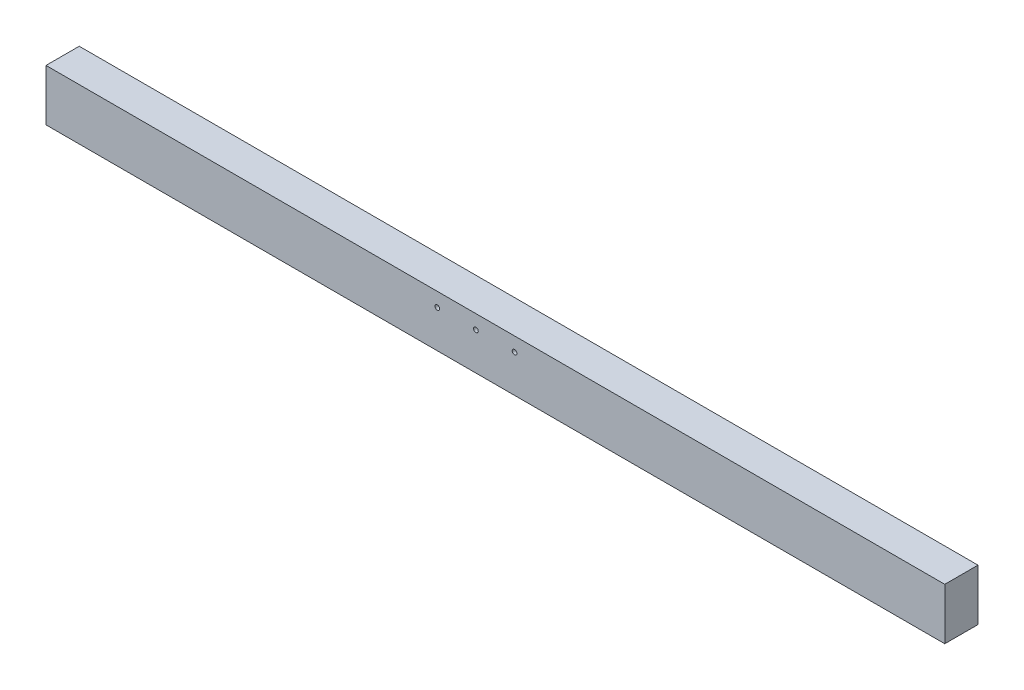
ISO-10303-21;
HEADER;
FILE_DESCRIPTION(('STEP AP214'),'2;1');
FILE_NAME('part.step','',(''),(''),'','','');
FILE_SCHEMA(('AUTOMOTIVE_DESIGN { 1 0 10303 214 1 1 1 1 }'));
ENDSEC;
DATA;
#1=APPLICATION_CONTEXT('core data for automotive mechanical design processes');
#2=APPLICATION_PROTOCOL_DEFINITION('international standard','automotive_design',2000,#1);
#3=PRODUCT_CONTEXT('',#1,'mechanical');
#4=PRODUCT('Part','Part','',(#3));
#5=PRODUCT_RELATED_PRODUCT_CATEGORY('part','',(#4));
#6=PRODUCT_DEFINITION_FORMATION('','',#4);
#7=PRODUCT_DEFINITION_CONTEXT('part definition',#1,'design');
#8=PRODUCT_DEFINITION('design','',#6,#7);
#9=PRODUCT_DEFINITION_SHAPE('','',#8);
#10=(LENGTH_UNIT() NAMED_UNIT(*) SI_UNIT(.MILLI.,.METRE.));
#11=(NAMED_UNIT(*) PLANE_ANGLE_UNIT() SI_UNIT($,.RADIAN.));
#12=(NAMED_UNIT(*) SI_UNIT($,.STERADIAN.) SOLID_ANGLE_UNIT());
#13=UNCERTAINTY_MEASURE_WITH_UNIT(LENGTH_MEASURE(1.E-05),#10,'distance_accuracy_value','');
#14=(GEOMETRIC_REPRESENTATION_CONTEXT(3) GLOBAL_UNCERTAINTY_ASSIGNED_CONTEXT((#13)) GLOBAL_UNIT_ASSIGNED_CONTEXT((#10,
#11,#12)) REPRESENTATION_CONTEXT('',''));
#15=CARTESIAN_POINT('',(0.,0.,0.));
#16=DIRECTION('',(0.,0.,1.));
#17=DIRECTION('',(1.,0.,0.));
#18=AXIS2_PLACEMENT_3D('',#15,#16,#17);
#19=CARTESIAN_POINT('',(1219.2,-76.2,45.085));
#20=DIRECTION('',(0.,0.,-1.));
#21=DIRECTION('',(-1.,0.,0.));
#22=AXIS2_PLACEMENT_3D('',#19,#20,#21);
#23=PLANE('',#22);
#24=CARTESIAN_POINT('',(51.975,-114.3,45.085));
#25=DIRECTION('',(0.,0.,1.));
#26=DIRECTION('',(1.,0.,0.));
#27=AXIS2_PLACEMENT_3D('',#24,#25,#26);
#28=CIRCLE('',#27,6.34999999999999);
#29=CARTESIAN_POINT('',(58.325,-114.3,45.085));
#30=VERTEX_POINT('',#29);
#31=EDGE_CURVE('E122',#30,#30,#28,.T.);
#32=ORIENTED_EDGE('',*,*,#31,.F.);
#33=EDGE_LOOP('',(#32));
#34=FACE_BOUND('',#33,.T.);
#35=CARTESIAN_POINT('',(-52.7999999999877,-114.3,45.085));
#36=DIRECTION('',(0.,0.,1.));
#37=DIRECTION('',(1.,0.,0.));
#38=AXIS2_PLACEMENT_3D('',#35,#36,#37);
#39=CIRCLE('',#38,6.34999999999989);
#40=CARTESIAN_POINT('',(-46.4499999999879,-114.3,45.085));
#41=VERTEX_POINT('',#40);
#42=EDGE_CURVE('E154',#41,#41,#39,.T.);
#43=ORIENTED_EDGE('',*,*,#42,.F.);
#44=EDGE_LOOP('',(#43));
#45=FACE_BOUND('',#44,.T.);
#46=CARTESIAN_POINT('',(-157.574999999975,-114.3,45.085));
#47=DIRECTION('',(0.,0.,1.));
#48=DIRECTION('',(1.,0.,0.));
#49=AXIS2_PLACEMENT_3D('',#46,#47,#48);
#50=CIRCLE('',#49,6.34999999999979);
#51=CARTESIAN_POINT('',(-151.224999999976,-114.3,45.085));
#52=VERTEX_POINT('',#51);
#53=EDGE_CURVE('E158',#52,#52,#50,.T.);
#54=ORIENTED_EDGE('',*,*,#53,.F.);
#55=EDGE_LOOP('',(#54));
#56=FACE_BOUND('',#55,.T.);
#57=DIRECTION('',(0.,-1.,0.));
#58=VECTOR('',#57,1.);
#59=CARTESIAN_POINT('',(-1219.2,-76.2,45.085));
#60=LINE('',#59,#58);
#61=CARTESIAN_POINT('',(-1219.2,-76.2,45.085));
#62=VERTEX_POINT('',#61);
#63=CARTESIAN_POINT('',(-1219.2,-215.9,45.085));
#64=VERTEX_POINT('',#63);
#65=EDGE_CURVE('E111',#62,#64,#60,.T.);
#66=ORIENTED_EDGE('',*,*,#65,.T.);
#67=DIRECTION('',(-1.,0.,0.));
#68=VECTOR('',#67,1.);
#69=CARTESIAN_POINT('',(1219.2,-215.9,45.085));
#70=LINE('',#69,#68);
#71=CARTESIAN_POINT('',(1219.2,-215.9,45.085));
#72=VERTEX_POINT('',#71);
#73=EDGE_CURVE('E11',#72,#64,#70,.T.);
#74=ORIENTED_EDGE('',*,*,#73,.F.);
#75=DIRECTION('',(0.,-1.,0.));
#76=VECTOR('',#75,1.);
#77=CARTESIAN_POINT('',(1219.2,-76.2,45.085));
#78=LINE('',#77,#76);
#79=CARTESIAN_POINT('',(1219.2,-76.2,45.085));
#80=VERTEX_POINT('',#79);
#81=EDGE_CURVE('E98',#80,#72,#78,.T.);
#82=ORIENTED_EDGE('',*,*,#81,.F.);
#83=DIRECTION('',(-1.,0.,0.));
#84=VECTOR('',#83,1.);
#85=CARTESIAN_POINT('',(1219.2,-76.2,45.085));
#86=LINE('',#85,#84);
#87=EDGE_CURVE('E107',#80,#62,#86,.T.);
#88=ORIENTED_EDGE('',*,*,#87,.T.);
#89=EDGE_LOOP('',(#66,#74,#82,#88));
#90=FACE_BOUND('',#89,.T.);
#91=ADVANCED_FACE('F45',(#34,#45,#56,#90),#23,.F.);
#92=CARTESIAN_POINT('',(1219.2,-215.9,45.085));
#93=DIRECTION('',(0.,1.,0.));
#94=DIRECTION('',(0.,0.,1.));
#95=AXIS2_PLACEMENT_3D('',#92,#93,#94);
#96=PLANE('',#95);
#97=DIRECTION('',(0.,0.,-1.));
#98=VECTOR('',#97,1.);
#99=CARTESIAN_POINT('',(-1219.2,-215.9,45.085));
#100=LINE('',#99,#98);
#101=CARTESIAN_POINT('',(-1219.2,-215.9,-45.085));
#102=VERTEX_POINT('',#101);
#103=EDGE_CURVE('E102',#64,#102,#100,.T.);
#104=ORIENTED_EDGE('',*,*,#103,.T.);
#105=DIRECTION('',(-1.,0.,0.));
#106=VECTOR('',#105,1.);
#107=CARTESIAN_POINT('',(1219.2,-215.9,-45.085));
#108=LINE('',#107,#106);
#109=CARTESIAN_POINT('',(1219.2,-215.9,-45.085));
#110=VERTEX_POINT('',#109);
#111=EDGE_CURVE('E54',#110,#102,#108,.T.);
#112=ORIENTED_EDGE('',*,*,#111,.F.);
#113=DIRECTION('',(0.,0.,-1.));
#114=VECTOR('',#113,1.);
#115=CARTESIAN_POINT('',(1219.2,-215.9,45.085));
#116=LINE('',#115,#114);
#117=EDGE_CURVE('E93',#72,#110,#116,.T.);
#118=ORIENTED_EDGE('',*,*,#117,.F.);
#119=ORIENTED_EDGE('',*,*,#73,.T.);
#120=EDGE_LOOP('',(#104,#112,#118,#119));
#121=FACE_BOUND('',#120,.T.);
#122=ADVANCED_FACE('F101',(#121),#96,.F.);
#123=CARTESIAN_POINT('',(1219.2,-215.9,-45.085));
#124=DIRECTION('',(0.,0.,1.));
#125=DIRECTION('',(1.,0.,0.));
#126=AXIS2_PLACEMENT_3D('',#123,#124,#125);
#127=PLANE('',#126);
#128=CARTESIAN_POINT('',(51.975,-114.3,-45.085));
#129=DIRECTION('',(0.,0.,1.));
#130=DIRECTION('',(1.,0.,0.));
#131=AXIS2_PLACEMENT_3D('',#128,#129,#130);
#132=CIRCLE('',#131,6.34999999999999);
#133=CARTESIAN_POINT('',(58.325,-114.3,-45.085));
#134=VERTEX_POINT('',#133);
#135=EDGE_CURVE('E48',#134,#134,#132,.T.);
#136=ORIENTED_EDGE('',*,*,#135,.T.);
#137=EDGE_LOOP('',(#136));
#138=FACE_BOUND('',#137,.T.);
#139=CARTESIAN_POINT('',(-52.7999999999877,-114.3,-45.085));
#140=DIRECTION('',(0.,0.,1.));
#141=DIRECTION('',(1.,0.,0.));
#142=AXIS2_PLACEMENT_3D('',#139,#140,#141);
#143=CIRCLE('',#142,6.34999999999989);
#144=CARTESIAN_POINT('',(-46.4499999999879,-114.3,-45.085));
#145=VERTEX_POINT('',#144);
#146=EDGE_CURVE('E121',#145,#145,#143,.T.);
#147=ORIENTED_EDGE('',*,*,#146,.T.);
#148=EDGE_LOOP('',(#147));
#149=FACE_BOUND('',#148,.T.);
#150=CARTESIAN_POINT('',(-157.574999999975,-114.3,-45.085));
#151=DIRECTION('',(0.,0.,1.));
#152=DIRECTION('',(1.,0.,0.));
#153=AXIS2_PLACEMENT_3D('',#150,#151,#152);
#154=CIRCLE('',#153,6.34999999999979);
#155=CARTESIAN_POINT('',(-151.224999999976,-114.3,-45.085));
#156=VERTEX_POINT('',#155);
#157=EDGE_CURVE('E119',#156,#156,#154,.T.);
#158=ORIENTED_EDGE('',*,*,#157,.T.);
#159=EDGE_LOOP('',(#158));
#160=FACE_BOUND('',#159,.T.);
#161=DIRECTION('',(0.,1.,0.));
#162=VECTOR('',#161,1.);
#163=CARTESIAN_POINT('',(-1219.2,-215.9,-45.085));
#164=LINE('',#163,#162);
#165=CARTESIAN_POINT('',(-1219.2,-76.2,-45.085));
#166=VERTEX_POINT('',#165);
#167=EDGE_CURVE('E80',#102,#166,#164,.T.);
#168=ORIENTED_EDGE('',*,*,#167,.T.);
#169=DIRECTION('',(-1.,0.,0.));
#170=VECTOR('',#169,1.);
#171=CARTESIAN_POINT('',(1219.2,-76.2,-45.085));
#172=LINE('',#171,#170);
#173=CARTESIAN_POINT('',(1219.2,-76.2,-45.085));
#174=VERTEX_POINT('',#173);
#175=EDGE_CURVE('E103',#174,#166,#172,.T.);
#176=ORIENTED_EDGE('',*,*,#175,.F.);
#177=DIRECTION('',(0.,1.,0.));
#178=VECTOR('',#177,1.);
#179=CARTESIAN_POINT('',(1219.2,-215.9,-45.085));
#180=LINE('',#179,#178);
#181=EDGE_CURVE('E96',#110,#174,#180,.T.);
#182=ORIENTED_EDGE('',*,*,#181,.F.);
#183=ORIENTED_EDGE('',*,*,#111,.T.);
#184=EDGE_LOOP('',(#168,#176,#182,#183));
#185=FACE_BOUND('',#184,.T.);
#186=ADVANCED_FACE('F105',(#138,#149,#160,#185),#127,.F.);
#187=CARTESIAN_POINT('',(1219.2,-76.2,-45.085));
#188=DIRECTION('',(0.,-1.,0.));
#189=DIRECTION('',(0.,0.,-1.));
#190=AXIS2_PLACEMENT_3D('',#187,#188,#189);
#191=PLANE('',#190);
#192=DIRECTION('',(0.,0.,1.));
#193=VECTOR('',#192,1.);
#194=CARTESIAN_POINT('',(-1219.2,-76.2,-45.085));
#195=LINE('',#194,#193);
#196=EDGE_CURVE('E86',#166,#62,#195,.T.);
#197=ORIENTED_EDGE('',*,*,#196,.T.);
#198=ORIENTED_EDGE('',*,*,#87,.F.);
#199=DIRECTION('',(0.,0.,1.));
#200=VECTOR('',#199,1.);
#201=CARTESIAN_POINT('',(1219.2,-76.2,-45.085));
#202=LINE('',#201,#200);
#203=EDGE_CURVE('E63',#174,#80,#202,.T.);
#204=ORIENTED_EDGE('',*,*,#203,.F.);
#205=ORIENTED_EDGE('',*,*,#175,.T.);
#206=EDGE_LOOP('',(#197,#198,#204,#205));
#207=FACE_BOUND('',#206,.T.);
#208=ADVANCED_FACE('F171',(#207),#191,.F.);
#209=CARTESIAN_POINT('',(1219.2,0.,0.));
#210=DIRECTION('',(1.,0.,0.));
#211=DIRECTION('',(0.,0.,-1.));
#212=AXIS2_PLACEMENT_3D('',#209,#210,#211);
#213=PLANE('',#212);
#214=ORIENTED_EDGE('',*,*,#81,.T.);
#215=ORIENTED_EDGE('',*,*,#117,.T.);
#216=ORIENTED_EDGE('',*,*,#181,.T.);
#217=ORIENTED_EDGE('',*,*,#203,.T.);
#218=EDGE_LOOP('',(#214,#215,#216,#217));
#219=FACE_BOUND('',#218,.T.);
#220=ADVANCED_FACE('F94',(#219),#213,.T.);
#221=CARTESIAN_POINT('',(-1219.2,0.,0.));
#222=DIRECTION('',(1.,0.,0.));
#223=DIRECTION('',(0.,0.,-1.));
#224=AXIS2_PLACEMENT_3D('',#221,#222,#223);
#225=PLANE('',#224);
#226=ORIENTED_EDGE('',*,*,#65,.F.);
#227=ORIENTED_EDGE('',*,*,#196,.F.);
#228=ORIENTED_EDGE('',*,*,#167,.F.);
#229=ORIENTED_EDGE('',*,*,#103,.F.);
#230=EDGE_LOOP('',(#226,#227,#228,#229));
#231=FACE_BOUND('',#230,.T.);
#232=ADVANCED_FACE('F161',(#231),#225,.F.);
#233=CARTESIAN_POINT('',(-157.574999999975,-114.3,-180.523275642422));
#234=DIRECTION('',(0.,0.,1.));
#235=DIRECTION('',(1.,0.,0.));
#236=AXIS2_PLACEMENT_3D('',#233,#234,#235);
#237=CYLINDRICAL_SURFACE('',#236,6.34999999999979);
#238=ORIENTED_EDGE('',*,*,#53,.T.);
#239=EDGE_LOOP('',(#238));
#240=FACE_BOUND('',#239,.T.);
#241=ORIENTED_EDGE('',*,*,#157,.F.);
#242=EDGE_LOOP('',(#241));
#243=FACE_BOUND('',#242,.T.);
#244=ADVANCED_FACE('F139',(#240,#243),#237,.F.);
#245=CARTESIAN_POINT('',(-52.7999999999877,-114.3,-180.523275642422));
#246=DIRECTION('',(0.,0.,1.));
#247=DIRECTION('',(1.,0.,0.));
#248=AXIS2_PLACEMENT_3D('',#245,#246,#247);
#249=CYLINDRICAL_SURFACE('',#248,6.34999999999989);
#250=ORIENTED_EDGE('',*,*,#42,.T.);
#251=EDGE_LOOP('',(#250));
#252=FACE_BOUND('',#251,.T.);
#253=ORIENTED_EDGE('',*,*,#146,.F.);
#254=EDGE_LOOP('',(#253));
#255=FACE_BOUND('',#254,.T.);
#256=ADVANCED_FACE('F132',(#252,#255),#249,.F.);
#257=CARTESIAN_POINT('',(51.975,-114.3,-180.523275642422));
#258=DIRECTION('',(0.,0.,1.));
#259=DIRECTION('',(1.,0.,0.));
#260=AXIS2_PLACEMENT_3D('',#257,#258,#259);
#261=CYLINDRICAL_SURFACE('',#260,6.34999999999999);
#262=ORIENTED_EDGE('',*,*,#31,.T.);
#263=EDGE_LOOP('',(#262));
#264=FACE_BOUND('',#263,.T.);
#265=ORIENTED_EDGE('',*,*,#135,.F.);
#266=EDGE_LOOP('',(#265));
#267=FACE_BOUND('',#266,.T.);
#268=ADVANCED_FACE('F130',(#264,#267),#261,.F.);
#269=CLOSED_SHELL('',(#91,#122,#186,#208,#220,#232,#244,#256,#268));
#270=MANIFOLD_SOLID_BREP('B2',#269);
#271=ADVANCED_BREP_SHAPE_REPRESENTATION('',(#18,#270),#14);
#272=SHAPE_DEFINITION_REPRESENTATION(#9,#271);
ENDSEC;
END-ISO-10303-21;
